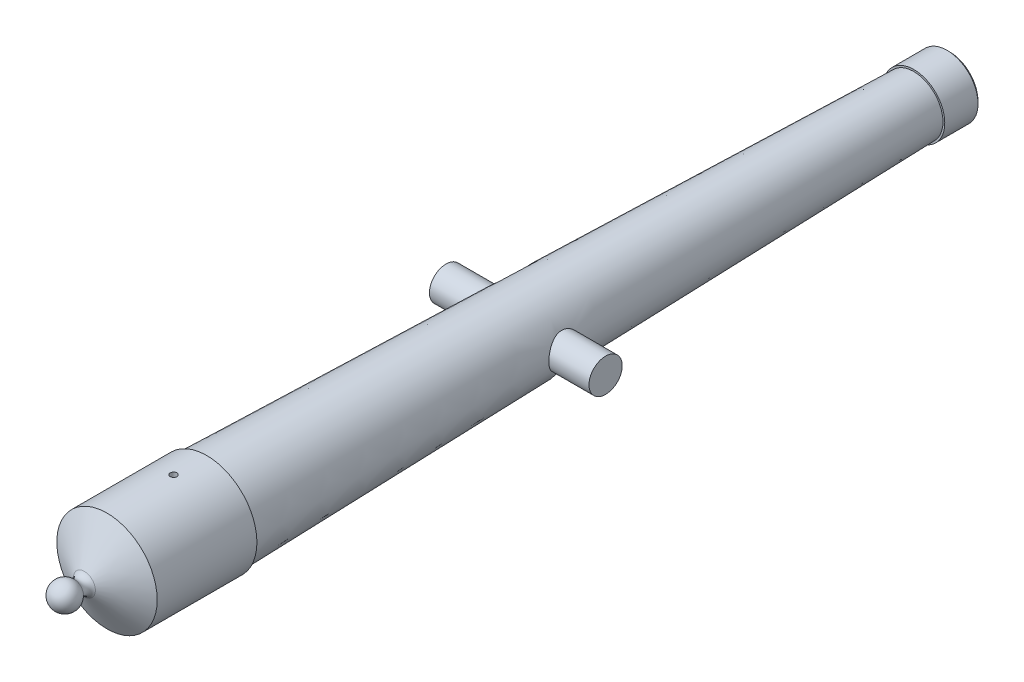
ISO-10303-21;
HEADER;
FILE_DESCRIPTION(('STEP AP214'),'2;1');
FILE_NAME('part.step','',(''),(''),'','','');
FILE_SCHEMA(('AUTOMOTIVE_DESIGN { 1 0 10303 214 1 1 1 1 }'));
ENDSEC;
DATA;
#1=APPLICATION_CONTEXT('core data for automotive mechanical design processes');
#2=APPLICATION_PROTOCOL_DEFINITION('international standard','automotive_design',2000,#1);
#3=PRODUCT_CONTEXT('',#1,'mechanical');
#4=PRODUCT('Part','Part','',(#3));
#5=PRODUCT_RELATED_PRODUCT_CATEGORY('part','',(#4));
#6=PRODUCT_DEFINITION_FORMATION('','',#4);
#7=PRODUCT_DEFINITION_CONTEXT('part definition',#1,'design');
#8=PRODUCT_DEFINITION('design','',#6,#7);
#9=PRODUCT_DEFINITION_SHAPE('','',#8);
#10=(LENGTH_UNIT() NAMED_UNIT(*) SI_UNIT(.MILLI.,.METRE.));
#11=(NAMED_UNIT(*) PLANE_ANGLE_UNIT() SI_UNIT($,.RADIAN.));
#12=(NAMED_UNIT(*) SI_UNIT($,.STERADIAN.) SOLID_ANGLE_UNIT());
#13=UNCERTAINTY_MEASURE_WITH_UNIT(LENGTH_MEASURE(1.E-05),#10,'distance_accuracy_value','');
#14=(GEOMETRIC_REPRESENTATION_CONTEXT(3) GLOBAL_UNCERTAINTY_ASSIGNED_CONTEXT((#13)) GLOBAL_UNIT_ASSIGNED_CONTEXT((#10,
#11,#12)) REPRESENTATION_CONTEXT('',''));
#15=CARTESIAN_POINT('',(0.,0.,0.));
#16=DIRECTION('',(0.,0.,1.));
#17=DIRECTION('',(1.,0.,0.));
#18=AXIS2_PLACEMENT_3D('',#15,#16,#17);
#19=CARTESIAN_POINT('',(0.,0.,101.6));
#20=DIRECTION('',(0.,0.,1.));
#21=DIRECTION('',(1.,0.,0.));
#22=AXIS2_PLACEMENT_3D('',#19,#20,#21);
#23=CYLINDRICAL_SURFACE('',#22,2.8321);
#24=CARTESIAN_POINT('',(0.,0.,-76.2000000000001));
#25=DIRECTION('',(0.,0.,1.));
#26=DIRECTION('',(1.,0.,0.));
#27=AXIS2_PLACEMENT_3D('',#24,#25,#26);
#28=CIRCLE('',#27,2.8321);
#29=CARTESIAN_POINT('',(2.8321,0.,-76.2000000000001));
#30=VERTEX_POINT('',#29);
#31=EDGE_CURVE('E53',#30,#30,#28,.T.);
#32=ORIENTED_EDGE('',*,*,#31,.F.);
#33=EDGE_LOOP('',(#32));
#34=FACE_BOUND('',#33,.T.);
#35=CARTESIAN_POINT('',(0.,0.,76.2000000000001));
#36=DIRECTION('',(0.,0.,1.));
#37=DIRECTION('',(1.,0.,0.));
#38=AXIS2_PLACEMENT_3D('',#35,#36,#37);
#39=CIRCLE('',#38,2.8321);
#40=CARTESIAN_POINT('',(2.8321,0.,76.2000000000001));
#41=VERTEX_POINT('',#40);
#42=EDGE_CURVE('E48',#41,#41,#39,.T.);
#43=ORIENTED_EDGE('',*,*,#42,.T.);
#44=EDGE_LOOP('',(#43));
#45=FACE_BOUND('',#44,.T.);
#46=CARTESIAN_POINT('',(0.,2.8321,66.6750000000001));
#47=CARTESIAN_POINT('',(0.0351963524602618,2.83209935485914,66.6750011701939));
#48=CARTESIAN_POINT('',(0.0704066552407901,2.83143724201221,66.6779361345388));
#49=CARTESIAN_POINT('',(0.139825618917245,2.82885992638437,66.6895853654994));
#50=CARTESIAN_POINT('',(0.174033571755433,2.82694385909442,66.6983036193229));
#51=CARTESIAN_POINT('',(0.240434686856917,2.82207178106052,66.7212314439598));
#52=CARTESIAN_POINT('',(0.272629964196245,2.81911688439737,66.7354351335811));
#53=CARTESIAN_POINT('',(0.334179599664716,2.81248535592582,66.768911625848));
#54=CARTESIAN_POINT('',(0.363534002374701,2.80880873544592,66.7881843489294));
#55=CARTESIAN_POINT('',(0.419063026986945,2.80106681911568,66.8315945928335));
#56=CARTESIAN_POINT('',(0.445183057813848,2.79699650054715,66.8558010547614));
#57=CARTESIAN_POINT('',(0.493028340785627,2.78896098338428,66.9082437060078));
#58=CARTESIAN_POINT('',(0.514753184984016,2.78499579457739,66.9364802689723));
#59=CARTESIAN_POINT('',(0.553434896322026,2.77756979577129,66.9965885931296));
#60=CARTESIAN_POINT('',(0.570333156645345,2.7741154125485,67.0284989348748));
#61=CARTESIAN_POINT('',(0.598505932135779,2.76817444149332,67.0947967419668));
#62=CARTESIAN_POINT('',(0.609781156587524,2.76568773160819,67.1291838942645));
#63=CARTESIAN_POINT('',(0.626206405460516,2.76201489990233,67.1988656064357));
#64=CARTESIAN_POINT('',(0.631453342776651,2.76080822481908,67.2341362153347));
#65=CARTESIAN_POINT('',(0.635974507122057,2.75977039435726,67.3050761285127));
#66=CARTESIAN_POINT('',(0.635249507044634,2.75993906098075,67.3407453806023));
#67=CARTESIAN_POINT('',(0.627925254798687,2.76161427078073,67.4107459626567));
#68=CARTESIAN_POINT('',(0.621439055956033,2.7630950644541,67.4450898316111));
#69=CARTESIAN_POINT('',(0.602955841259217,2.76718691551238,67.5121891859686));
#70=CARTESIAN_POINT('',(0.590958502179467,2.76979803919006,67.5449445780838));
#71=CARTESIAN_POINT('',(0.561691020798786,2.77588142441652,67.6082525367978));
#72=CARTESIAN_POINT('',(0.544377817967379,2.779360673316,67.6387844969479));
#73=CARTESIAN_POINT('',(0.505000315647921,2.78678405826388,67.6965514610428));
#74=CARTESIAN_POINT('',(0.482935337474432,2.79072826068409,67.7237859931545));
#75=CARTESIAN_POINT('',(0.434084313275282,2.79874728246331,67.774835417385));
#76=CARTESIAN_POINT('',(0.407202250497429,2.80282303155951,67.798558376429));
#77=CARTESIAN_POINT('',(0.349794629970767,2.81056430259154,67.8411747861984));
#78=CARTESIAN_POINT('',(0.319268999568012,2.81422981634433,67.8600681405963));
#79=CARTESIAN_POINT('',(0.25532540181894,2.8207504776185,67.8925135472286));
#80=CARTESIAN_POINT('',(0.221900872852387,2.82360372063829,67.9060530749619));
#81=CARTESIAN_POINT('',(0.153172769477996,2.82816426854037,67.9272975598389));
#82=CARTESIAN_POINT('',(0.11786948341276,2.82987174872454,67.9350034095592));
#83=CARTESIAN_POINT('',(0.047174136899716,2.83192326657826,67.94422697471));
#84=CARTESIAN_POINT('',(0.0117992323502716,2.83229495480176,67.9458702041948));
#85=CARTESIAN_POINT('',(-0.0587196603745117,2.831710704929,67.9432627571052));
#86=CARTESIAN_POINT('',(-0.0938636648712814,2.83075486170767,67.9390125017217));
#87=CARTESIAN_POINT('',(-0.162503900824789,2.82764044507157,67.9248427273887));
#88=CARTESIAN_POINT('',(-0.196014508525435,2.82549593878739,67.9149894818526));
#89=CARTESIAN_POINT('',(-0.260907072196644,2.82024442979528,67.8899673397754));
#90=CARTESIAN_POINT('',(-0.29228884031319,2.81713734228115,67.8747979748533));
#91=CARTESIAN_POINT('',(-0.352548676075544,2.81023739629906,67.83931575125));
#92=CARTESIAN_POINT('',(-0.381382548310373,2.80643502289873,67.8189297270546));
#93=CARTESIAN_POINT('',(-0.435265071618265,2.79858489727152,67.7736887310025));
#94=CARTESIAN_POINT('',(-0.46031320346165,2.79453711149183,67.7488331471494));
#95=CARTESIAN_POINT('',(-0.506413024676474,2.78655617662403,67.6947813607716));
#96=CARTESIAN_POINT('',(-0.527377591714516,2.78262678389646,67.6655101933322));
#97=CARTESIAN_POINT('',(-0.564094139235672,2.77541703577372,67.6037890139334));
#98=CARTESIAN_POINT('',(-0.57984634862883,2.77213665187872,67.5713391416537));
#99=CARTESIAN_POINT('',(-0.605582121410344,2.76662864144735,67.5043574553291));
#100=CARTESIAN_POINT('',(-0.615598673848126,2.76439500822464,67.4698388349259));
#101=CARTESIAN_POINT('',(-0.629674162248547,2.76122325655301,67.399551549496));
#102=CARTESIAN_POINT('',(-0.633734106984656,2.76028491874264,67.3637830971836));
#103=CARTESIAN_POINT('',(-0.635736516960403,2.75982431817365,67.2928911665245));
#104=CARTESIAN_POINT('',(-0.633817283811176,2.76027004056894,67.2577717327282));
#105=CARTESIAN_POINT('',(-0.624226224060342,2.76245466521834,67.1883704739342));
#106=CARTESIAN_POINT('',(-0.61655447251639,2.76419355059952,67.1540886380137));
#107=CARTESIAN_POINT('',(-0.595744486465689,2.76875258000252,67.0874523154646));
#108=CARTESIAN_POINT('',(-0.58262735216757,2.77156854718437,67.055090934589));
#109=CARTESIAN_POINT('',(-0.551316723581451,2.77796589041847,66.9930079960386));
#110=CARTESIAN_POINT('',(-0.533122669767625,2.78154735082533,66.9632867298061));
#111=CARTESIAN_POINT('',(-0.491720152309636,2.78916705336809,66.9066481193888));
#112=CARTESIAN_POINT('',(-0.468413547098827,2.79321337057468,66.8798035889343));
#113=CARTESIAN_POINT('',(-0.417645170024492,2.80125368082617,66.8303612887077));
#114=CARTESIAN_POINT('',(-0.390182435913955,2.80524766152057,66.807764505118));
#115=CARTESIAN_POINT('',(-0.331424942427255,2.81279866876162,66.7671598839993));
#116=CARTESIAN_POINT('',(-0.300082578068513,2.81634891308478,66.7492195976392));
#117=CARTESIAN_POINT('',(-0.23475345991419,2.82254389131537,66.7188904703999));
#118=CARTESIAN_POINT('',(-0.200768898243394,2.82518936623882,66.7064970839685));
#119=CARTESIAN_POINT('',(-0.138970661939898,2.82881793978781,66.689761953138));
#120=CARTESIAN_POINT('',(-0.111485324218245,2.83004095471679,66.6842370068206));
#121=CARTESIAN_POINT('',(-0.0560029185259434,2.83168222189339,66.6768556540354));
#122=CARTESIAN_POINT('',(-0.028005875548816,2.83210051334111,66.6749990688722));
#123=CARTESIAN_POINT('',(0.,2.8321,66.6750000000001));
#124=B_SPLINE_CURVE_WITH_KNOTS('',3,(#46,#47,#48,#49,#50,#51,#52,#53,#54,#55,#56,#57,#58,#59,
#60,#61,#62,#63,#64,#65,#66,#67,#68,#69,#70,#71,#72,#73,#74,#75,#76,#77,#78,#79,#80,#81,#82,#83,
#84,#85,#86,#87,#88,#89,#90,#91,#92,#93,#94,#95,#96,#97,#98,#99,#100,#101,#102,#103,#104,#105,
#106,#107,#108,#109,#110,#111,#112,#113,#114,#115,#116,#117,#118,#119,#120,#121,#122,#123),
.UNSPECIFIED.,.T.,.F.,(4,2,2,2,2,2,2,2,2,2,2,2,2,2,2,2,2,2,2,2,2,2,2,2,2,2,2,2,2,2,2,2,2,2,2,2,
2,2,4),(0.,0.105486525546016,0.211045852987066,0.316492318129971,0.421937128270393,
0.528971127894894,0.636015057503189,0.744308308306199,0.852587895639793,0.959101249686989,
1.06560081890033,1.1700555887756,1.27451648565262,1.37984693562243,1.48519243969417,
1.59293547407842,1.70068065725356,1.80867642425109,1.9166556641113,2.02238645649506,
2.12810969298667,2.23260767562303,2.33711486745447,2.44317688225452,2.54925343071576,
2.65739137014389,2.76552455986976,2.87302939994838,2.98051603158365,3.08553505053502,
3.19055269924408,3.2951671602089,3.39979315525987,3.50663754724385,3.61350671430867,
3.72184904343782,3.83010242532253,3.91404255602459,3.9979785976884),.UNSPECIFIED.);
#125=CARTESIAN_POINT('',(0.,2.8321,66.6750000000001));
#126=VERTEX_POINT('',#125);
#127=EDGE_CURVE('E114',#126,#126,#124,.T.);
#128=ORIENTED_EDGE('',*,*,#127,.F.);
#129=EDGE_LOOP('',(#128));
#130=FACE_BOUND('',#129,.T.);
#131=ADVANCED_FACE('F32',(#34,#45,#130),#23,.F.);
#132=CARTESIAN_POINT('',(0.,0.,101.6));
#133=DIRECTION('',(0.,0.,1.));
#134=DIRECTION('',(1.,0.,0.));
#135=AXIS2_PLACEMENT_3D('',#132,#133,#134);
#136=CYLINDRICAL_SURFACE('',#135,9.58833936230612);
#137=CARTESIAN_POINT('',(0.,0.,80.01));
#138=DIRECTION('',(0.,0.,1.));
#139=DIRECTION('',(1.,0.,0.));
#140=AXIS2_PLACEMENT_3D('',#137,#138,#139);
#141=CIRCLE('',#140,9.58833936230612);
#142=CARTESIAN_POINT('',(9.58833936230612,0.,80.01));
#143=VERTEX_POINT('',#142);
#144=EDGE_CURVE('E154',#143,#143,#141,.T.);
#145=ORIENTED_EDGE('',*,*,#144,.F.);
#146=EDGE_LOOP('',(#145));
#147=FACE_BOUND('',#146,.T.);
#148=CARTESIAN_POINT('',(0.,0.,60.9600000000001));
#149=DIRECTION('',(0.,0.,1.));
#150=DIRECTION('',(1.,0.,0.));
#151=AXIS2_PLACEMENT_3D('',#148,#149,#150);
#152=CIRCLE('',#151,9.58833936230612);
#153=CARTESIAN_POINT('',(9.58833936230612,0.,60.9600000000001));
#154=VERTEX_POINT('',#153);
#155=EDGE_CURVE('E157',#154,#154,#152,.T.);
#156=ORIENTED_EDGE('',*,*,#155,.T.);
#157=EDGE_LOOP('',(#156));
#158=FACE_BOUND('',#157,.T.);
#159=CARTESIAN_POINT('',(0.,9.58833936230612,66.6750000000001));
#160=CARTESIAN_POINT('',(-0.0356263381764343,9.58833908340412,66.675001565858));
#161=CARTESIAN_POINT('',(-0.0712775124958322,9.58813868058843,66.6780082716786));
#162=CARTESIAN_POINT('',(-0.141595137635909,9.58735850071565,66.6899592847891));
#163=CARTESIAN_POINT('',(-0.176260398522241,9.58677828396668,66.6989104738889));
#164=CARTESIAN_POINT('',(-0.243577485565111,9.58530410314541,66.722491948931));
#165=CARTESIAN_POINT('',(-0.276230375290769,9.58441030650605,66.7371192046337));
#166=CARTESIAN_POINT('',(-0.338608997471518,9.58240944670513,66.7716326027186));
#167=CARTESIAN_POINT('',(-0.368335391194416,9.58130243189002,66.7915175533177));
#168=CARTESIAN_POINT('',(-0.424075085208356,9.57899747572216,66.8360180194038));
#169=CARTESIAN_POINT('',(-0.450082866723912,9.57779940318508,66.8606404412939));
#170=CARTESIAN_POINT('',(-0.497599842001435,9.57544847784538,66.9139025913876));
#171=CARTESIAN_POINT('',(-0.519108846308606,9.57429562694882,66.9425424886924));
#172=CARTESIAN_POINT('',(-0.557035086344867,9.57216412795181,67.0030583437478));
#173=CARTESIAN_POINT('',(-0.573447678419611,9.57118563906715,67.0349372178391));
#174=CARTESIAN_POINT('',(-0.600685499988818,9.56951492773157,67.1010056787514));
#175=CARTESIAN_POINT('',(-0.611510795631856,9.56882270189158,67.1351952382104));
#176=CARTESIAN_POINT('',(-0.627251261026589,9.56780384178496,67.2048608927967));
#177=CARTESIAN_POINT('',(-0.632175156167297,9.56747666782829,67.2403350084631));
#178=CARTESIAN_POINT('',(-0.635999987923012,9.56722319167062,67.3116076340199));
#179=CARTESIAN_POINT('',(-0.634900999815673,9.56729688445936,67.3474061398502));
#180=CARTESIAN_POINT('',(-0.626718496348319,9.56783633052427,67.4182518499238));
#181=CARTESIAN_POINT('',(-0.61964442927196,9.56830146481688,67.453300150789));
#182=CARTESIAN_POINT('',(-0.599727233553266,9.5695704037247,67.5217107615775));
#183=CARTESIAN_POINT('',(-0.5868840668847,9.57037421057223,67.5550730603862));
#184=CARTESIAN_POINT('',(-0.555782539486094,9.57223062607182,67.6191949501474));
#185=CARTESIAN_POINT('',(-0.537519900169492,9.57328343117018,67.6499524599068));
#186=CARTESIAN_POINT('',(-0.496100934369649,9.57551900863177,67.7079689250711));
#187=CARTESIAN_POINT('',(-0.472944545894756,9.5767017826413,67.7352278361504));
#188=CARTESIAN_POINT('',(-0.422342227416284,9.57906676098503,67.7855282896488));
#189=CARTESIAN_POINT('',(-0.394888121900467,9.58024895983487,67.8085616085534));
#190=CARTESIAN_POINT('',(-0.33649832925831,9.58247737977207,67.8496935908372));
#191=CARTESIAN_POINT('',(-0.305562640770609,9.58352360080626,67.8677922522868));
#192=CARTESIAN_POINT('',(-0.241082788540885,9.58536227400322,67.8985404981024));
#193=CARTESIAN_POINT('',(-0.207538471847826,9.586154711272,67.9111897626704));
#194=CARTESIAN_POINT('',(-0.138795826628237,9.58739632813821,67.930674613478));
#195=CARTESIAN_POINT('',(-0.103597519791943,9.58784551223569,67.937510275934));
#196=CARTESIAN_POINT('',(-0.0326173838901671,9.58834942869641,67.9451636742789));
#197=CARTESIAN_POINT('',(0.00316321436565463,9.58840490618591,67.9459927781988));
#198=CARTESIAN_POINT('',(0.0743549643529414,9.58811714133276,67.9416392393711));
#199=CARTESIAN_POINT('',(0.109766118245429,9.58777390132369,67.9364566318082));
#200=CARTESIAN_POINT('',(0.179181700618725,9.58672781487848,67.9202361994703));
#201=CARTESIAN_POINT('',(0.213187355072257,9.58602528930986,67.9092035988313));
#202=CARTESIAN_POINT('',(0.278864504084136,9.58433964918834,67.8816016658911));
#203=CARTESIAN_POINT('',(0.31053597509481,9.58335653180525,67.8650322777432));
#204=CARTESIAN_POINT('',(0.370697727595723,9.58121827577734,67.8267982336522));
#205=CARTESIAN_POINT('',(0.399183180876022,9.58006288207826,67.8051259949369));
#206=CARTESIAN_POINT('',(0.452115674885338,9.57771092298612,67.7573124689324));
#207=CARTESIAN_POINT('',(0.476562671089189,9.5765143571393,67.7311711323765));
#208=CARTESIAN_POINT('',(0.520762876300027,9.57421274825703,67.6751123759949));
#209=CARTESIAN_POINT('',(0.540508703355369,9.57310785091212,67.6451891289812));
#210=CARTESIAN_POINT('',(0.57469554533094,9.57111651029325,67.582445204901));
#211=CARTESIAN_POINT('',(0.58913659621136,9.57023006553844,67.5496245474776));
#212=CARTESIAN_POINT('',(0.612291207054163,9.5687766521329,67.4820442932158));
#213=CARTESIAN_POINT('',(0.621009393031656,9.56820942549876,67.4472862871325));
#214=CARTESIAN_POINT('',(0.632485897839024,9.56745770331832,67.3767959408195));
#215=CARTESIAN_POINT('',(0.635244284495478,9.56727320341634,67.3410636116829));
#216=CARTESIAN_POINT('',(0.63472221946956,9.56730784728902,67.2697123199176));
#217=CARTESIAN_POINT('',(0.631453371873284,9.5675262154322,67.2340932714271));
#218=CARTESIAN_POINT('',(0.618993709667073,9.56834034464386,67.1639110163007));
#219=CARTESIAN_POINT('',(0.609802884550793,9.56893610638189,67.1293478115382));
#220=CARTESIAN_POINT('',(0.585762832237384,9.57043769538769,67.0622567906806));
#221=CARTESIAN_POINT('',(0.570913681327877,9.57134351847509,67.0297289471509));
#222=CARTESIAN_POINT('',(0.535980016534799,9.57336314552924,66.9676264177384));
#223=CARTESIAN_POINT('',(0.515895629766568,9.574476944446,66.9380516601767));
#224=CARTESIAN_POINT('',(0.471018511622355,9.5767895249299,66.8826358340605));
#225=CARTESIAN_POINT('',(0.446217339897961,9.57798845638806,66.856801607153));
#226=CARTESIAN_POINT('',(0.392622981784599,9.58033489981896,66.8096539970795));
#227=CARTESIAN_POINT('',(0.363828821933992,9.58148239916237,66.7883417195474));
#228=CARTESIAN_POINT('',(0.303029541678256,9.58359800322181,66.7508253023406));
#229=CARTESIAN_POINT('',(0.271020189597222,9.58456586661274,66.7346280140165));
#230=CARTESIAN_POINT('',(0.204752938631347,9.5862099874925,66.7078576822841));
#231=CARTESIAN_POINT('',(0.170497718337614,9.58688658533015,66.6972780711278));
#232=CARTESIAN_POINT('',(0.113361730512231,9.58769520169712,66.6847844338146));
#233=CARTESIAN_POINT('',(0.0908500093664952,9.58793568427544,66.6811200363836));
#234=CARTESIAN_POINT('',(0.0455622451409613,9.58825785364645,66.6762273206381));
#235=CARTESIAN_POINT('',(0.0227862024766167,9.58833954068869,66.6749989984951));
#236=CARTESIAN_POINT('',(0.,9.58833936230612,66.6750000000001));
#237=B_SPLINE_CURVE_WITH_KNOTS('',3,(#159,#160,#161,#162,#163,#164,#165,#166,#167,#168,#169,
#170,#171,#172,#173,#174,#175,#176,#177,#178,#179,#180,#181,#182,#183,#184,#185,#186,#187,#188,
#189,#190,#191,#192,#193,#194,#195,#196,#197,#198,#199,#200,#201,#202,#203,#204,#205,#206,#207,
#208,#209,#210,#211,#212,#213,#214,#215,#216,#217,#218,#219,#220,#221,#222,#223,#224,#225,#226,
#227,#228,#229,#230,#231,#232,#233,#234,#235,#236),.UNSPECIFIED.,.T.,.F.,(4,2,2,2,2,2,2,2,2,2,2,
2,2,2,2,2,2,2,2,2,2,2,2,2,2,2,2,2,2,2,2,2,2,2,2,2,2,2,4),(0.,0.106795829601662,
0.213715510636647,0.320578189609931,0.42741666632006,0.534412091362312,0.641412021343529,
0.748509161379615,0.855605033452587,0.962542365111097,1.06947836020492,1.17624557524107,
1.28301349402906,1.38986592964576,1.49671971889864,1.60377930227428,1.71083892751228,
1.81790483468973,1.92496933820878,2.03183115805585,2.13869235247614,2.24545827848562,
2.35222528142208,2.45915195138458,2.56607980016614,2.673174459741,2.78026839332566,
2.88727565175114,2.99428169235465,3.10108193193563,3.20788236099443,3.31468135018164,
3.42147774645313,3.52846707659113,3.6354825359602,3.74264073672061,3.84967337911999,
3.91797888975845,3.98628429305054),.UNSPECIFIED.);
#238=CARTESIAN_POINT('',(0.,9.58833936230612,66.6750000000001));
#239=VERTEX_POINT('',#238);
#240=EDGE_CURVE('E10',#239,#239,#237,.T.);
#241=ORIENTED_EDGE('',*,*,#240,.F.);
#242=EDGE_LOOP('',(#241));
#243=FACE_BOUND('',#242,.T.);
#244=ADVANCED_FACE('F89',(#147,#158,#243),#136,.T.);
#245=CARTESIAN_POINT('',(0.,0.,-74.1436852739432));
#246=DIRECTION('',(0.,0.,1.));
#247=DIRECTION('',(1.,0.,0.));
#248=AXIS2_PLACEMENT_3D('',#245,#246,#247);
#249=CONICAL_SURFACE('',#248,5.55168305012148,0.0261799387799152);
#250=CARTESIAN_POINT('',(-7.1246128347311,-2.11225151051641,-2.37044691067342));
#251=CARTESIAN_POINT('',(-7.15999376364011,-1.98222892964537,-2.48630147221821));
#252=CARTESIAN_POINT('',(-7.19473527022546,-1.84237573152468,-2.59169004133909));
#253=CARTESIAN_POINT('',(-7.25915606273021,-1.54616934053915,-2.77862303466659));
#254=CARTESIAN_POINT('',(-7.28882490551409,-1.38978315656129,-2.86011851059022));
#255=CARTESIAN_POINT('',(-7.33983565995534,-1.06408999176591,-2.9965876068236));
#256=CARTESIAN_POINT('',(-7.36116068958053,-0.894757635529039,-3.05150750936889));
#257=CARTESIAN_POINT('',(-7.39290274933913,-0.548422700220657,-3.13232063943203));
#258=CARTESIAN_POINT('',(-7.40332946457271,-0.371427077281799,-3.15823964088036));
#259=CARTESIAN_POINT('',(-7.41184838362086,-0.0239170882217485,-3.17944733220351));
#260=CARTESIAN_POINT('',(-7.41051165154849,0.146497756379075,-3.17615408516061));
#261=CARTESIAN_POINT('',(-7.39701257942944,0.484183556321644,-3.14244869409472));
#262=CARTESIAN_POINT('',(-7.38484972664048,0.651454362373572,-3.11203526561671));
#263=CARTESIAN_POINT('',(-7.35134304577096,0.974961517901067,-3.02614696067529));
#264=CARTESIAN_POINT('',(-7.33017856530501,1.1313473882293,-2.9711606400656));
#265=CARTESIAN_POINT('',(-7.28082275895696,1.43276686450873,-2.83812658874332));
#266=CARTESIAN_POINT('',(-7.25262993216295,1.57779803694616,-2.76007393152542));
#267=CARTESIAN_POINT('',(-7.19027304309886,1.86090567341539,-2.57826806882757));
#268=CARTESIAN_POINT('',(-7.15586871014839,1.9981834075467,-2.47335443315792));
#269=CARTESIAN_POINT('',(-7.08584060098458,2.25384910289186,-2.24286434370983));
#270=CARTESIAN_POINT('',(-7.05021624157377,2.37222787251622,-2.11727789556571));
#271=CARTESIAN_POINT('',(-6.97974389844495,2.59334591367021,-1.84070961022607));
#272=CARTESIAN_POINT('',(-6.94504614218922,2.69486836337208,-1.68871151049311));
#273=CARTESIAN_POINT('',(-6.8832766233603,2.87082419925069,-1.36834038980815));
#274=CARTESIAN_POINT('',(-6.85620210906572,2.94526736293407,-1.19997330708046));
#275=CARTESIAN_POINT('',(-6.81462586851435,3.06213162077838,-0.857622460918351));
#276=CARTESIAN_POINT('',(-6.79971622855255,3.10558488676991,-0.684043215590818));
#277=CARTESIAN_POINT('',(-6.78353989641082,3.16268665063382,-0.331472413816595));
#278=CARTESIAN_POINT('',(-6.78226415033795,3.17635492309666,-0.152484528316582));
#279=CARTESIAN_POINT('',(-6.79347629068658,3.17354921981639,0.190187113202122));
#280=CARTESIAN_POINT('',(-6.80485510713671,3.15943241533724,0.353933545983246));
#281=CARTESIAN_POINT('',(-6.83847127247029,3.1064520029697,0.676208414620445));
#282=CARTESIAN_POINT('',(-6.8607104626372,3.06758419842116,0.834735960792438));
#283=CARTESIAN_POINT('',(-6.91397585069742,2.96618021737237,1.14420061043446));
#284=CARTESIAN_POINT('',(-6.94508755793479,2.90341161934449,1.29504613315503));
#285=CARTESIAN_POINT('',(-7.01294625934913,2.75621364024617,1.58438817562543));
#286=CARTESIAN_POINT('',(-7.04969540365024,2.67177598627277,1.7228799516362));
#287=CARTESIAN_POINT('',(-7.12899628271655,2.47469701852218,1.99686828019961));
#288=CARTESIAN_POINT('',(-7.171772378902,2.36019810107457,2.13096654723048));
#289=CARTESIAN_POINT('',(-7.25598227798737,2.11033975604448,2.37866661711723));
#290=CARTESIAN_POINT('',(-7.29741557258912,1.97497253815543,2.49226073108546));
#291=CARTESIAN_POINT('',(-7.37654566806763,1.68031944680577,2.70017511923543));
#292=CARTESIAN_POINT('',(-7.41402270442476,1.5202860362545,2.79352657113465));
#293=CARTESIAN_POINT('',(-7.4791561003,1.1847707133123,2.95148587730396));
#294=CARTESIAN_POINT('',(-7.50681773996703,1.00929717047055,3.0161091904932));
#295=CARTESIAN_POINT('',(-7.54784474289805,0.65928835489446,3.11075403216195));
#296=CARTESIAN_POINT('',(-7.5619808887804,0.485351861193323,3.14264981507779));
#297=CARTESIAN_POINT('',(-7.57724814791549,0.13406057313679,3.17706760490017));
#298=CARTESIAN_POINT('',(-7.57838522150381,-0.0432926172247866,3.17960307410678));
#299=CARTESIAN_POINT('',(-7.56792255195734,-0.38341109626145,3.15605520432914));
#300=CARTESIAN_POINT('',(-7.55719014936829,-0.546343313183532,3.13192081514454));
#301=CARTESIAN_POINT('',(-7.5253947245455,-0.865558367735012,3.05912381759037));
#302=CARTESIAN_POINT('',(-7.50433100635781,-1.02184075663761,3.01045955679581));
#303=CARTESIAN_POINT('',(-7.45341404541591,-1.32610204075357,2.88951253153468));
#304=CARTESIAN_POINT('',(-7.42343706583766,-1.47392654964094,2.81689558252814));
#305=CARTESIAN_POINT('',(-7.35742746992832,-1.75564330390697,2.65049671889033));
#306=CARTESIAN_POINT('',(-7.32139275368677,-1.88953069184178,2.55670746101339));
#307=CARTESIAN_POINT('',(-7.24331485326426,-2.15067454704954,2.34221094678358));
#308=CARTESIAN_POINT('',(-7.20102230297838,-2.27660337778855,2.21997655519692));
#309=CARTESIAN_POINT('',(-7.11684885102909,-2.5067838152281,1.95635041729137));
#310=CARTESIAN_POINT('',(-7.07496816505039,-2.6110245860716,1.81494915274487));
#311=CARTESIAN_POINT('',(-6.99393094042303,-2.79959791580668,1.50886348450374));
#312=CARTESIAN_POINT('',(-6.95499482993248,-2.88276506144415,1.34339731053314));
#313=CARTESIAN_POINT('',(-6.88689055859711,-3.01949559472005,0.998785264275071));
#314=CARTESIAN_POINT('',(-6.85771614268839,-3.07307795396059,0.819648242679327));
#315=CARTESIAN_POINT('',(-6.81437290896255,-3.14584344390147,0.4639563577973));
#316=CARTESIAN_POINT('',(-6.79941615676658,-3.16687971271875,0.287879428672782));
#317=CARTESIAN_POINT('',(-6.78342066010366,-3.17923885418155,-0.0658902726941524));
#318=CARTESIAN_POINT('',(-6.78237323040945,-3.17058027306804,-0.243581967269628));
#319=CARTESIAN_POINT('',(-6.79343562992421,-3.12572388657815,-0.5805806351356));
#320=CARTESIAN_POINT('',(-6.80450857689991,-3.09176460997802,-0.74022803019675));
#321=CARTESIAN_POINT('',(-6.83647745679473,-3.00017637957253,-1.0516299423528));
#322=CARTESIAN_POINT('',(-6.8573804375624,-2.94253044687294,-1.20337870951844));
#323=CARTESIAN_POINT('',(-6.90703789649572,-2.80349329421534,-1.49953345014391));
#324=CARTESIAN_POINT('',(-6.93599955886204,-2.72147094311343,-1.6436059469076));
#325=CARTESIAN_POINT('',(-6.99807972728765,-2.53669930960379,-1.91647070371086));
#326=CARTESIAN_POINT('',(-7.03119080599567,-2.43398686722855,-2.04528948559071));
#327=CARTESIAN_POINT('',(-7.07463302480727,-2.28876583597861,-2.2010401889124));
#328=CARTESIAN_POINT('',(-7.08465039286108,-2.25456878110794,-2.23605418797465));
#329=CARTESIAN_POINT('',(-7.10466630286236,-2.1845907677328,-2.30447028613746));
#330=CARTESIAN_POINT('',(-7.11466484373502,-2.14880972149835,-2.33787229574268));
#331=CARTESIAN_POINT('',(-7.1246128347311,-2.11225151051641,-2.37044691067342));
#332=B_SPLINE_CURVE_WITH_KNOTS('',3,(#250,#251,#252,#253,#254,#255,#256,#257,#258,#259,#260,
#261,#262,#263,#264,#265,#266,#267,#268,#269,#270,#271,#272,#273,#274,#275,#276,#277,#278,#279,
#280,#281,#282,#283,#284,#285,#286,#287,#288,#289,#290,#291,#292,#293,#294,#295,#296,#297,#298,
#299,#300,#301,#302,#303,#304,#305,#306,#307,#308,#309,#310,#311,#312,#313,#314,#315,#316,#317,
#318,#319,#320,#321,#322,#323,#324,#325,#326,#327,#328,#329,#330,#331),.UNSPECIFIED.,.T.,.F.,(4,
2,2,2,2,2,2,2,2,2,2,2,2,2,2,2,2,2,2,2,2,2,2,2,2,2,2,2,2,2,2,2,2,2,2,2,2,2,2,2,4),(0.,
0.532943065217061,1.06697042828028,1.6020727692455,2.13669917078285,2.64552050479345,
3.15436593867349,3.65351596208527,4.15277267103991,4.67899508570945,5.2054726562433,
5.76087991966074,6.31608644287927,6.85180704225732,7.38717186223581,7.87907001232739,
8.37105158851089,8.86794491220939,9.36502822488174,9.90697228427663,10.4491191479152,
11.0132592965639,11.577095506803,12.1064530755463,12.6355679134785,13.1284298040472,
13.6213249000963,14.1214102174117,14.6216692477996,15.1608730512573,15.7003456099048,
16.2651635614911,16.8296188948214,17.3605680946157,17.8911857447279,18.3797213979788,
18.8686078523581,19.3714565693522,19.8734177229341,20.0232560394592,20.1731026652456),.UNSPECIFIED.);
#333=CARTESIAN_POINT('',(-7.1246128347311,-2.11225151051641,-2.37044691067342));
#334=VERTEX_POINT('',#333);
#335=EDGE_CURVE('E61',#334,#334,#332,.T.);
#336=ORIENTED_EDGE('',*,*,#335,.T.);
#337=EDGE_LOOP('',(#336));
#338=FACE_BOUND('',#337,.T.);
#339=CARTESIAN_POINT('',(0.,0.,60.9600000000001));
#340=DIRECTION('',(0.,0.,1.));
#341=DIRECTION('',(1.,0.,0.));
#342=AXIS2_PLACEMENT_3D('',#339,#340,#341);
#343=CIRCLE('',#342,9.08949755641311);
#344=CARTESIAN_POINT('',(9.08949755641311,0.,60.9600000000001));
#345=VERTEX_POINT('',#344);
#346=EDGE_CURVE('E160',#345,#345,#343,.T.);
#347=ORIENTED_EDGE('',*,*,#346,.F.);
#348=EDGE_LOOP('',(#347));
#349=FACE_BOUND('',#348,.T.);
#350=CARTESIAN_POINT('',(0.,0.,-74.1436852739432));
#351=DIRECTION('',(0.,0.,1.));
#352=DIRECTION('',(1.,0.,0.));
#353=AXIS2_PLACEMENT_3D('',#350,#351,#352);
#354=CIRCLE('',#353,5.55168305012148);
#355=CARTESIAN_POINT('',(5.55168305012148,0.,-74.1436852739432));
#356=VERTEX_POINT('',#355);
#357=EDGE_CURVE('E163',#356,#356,#354,.T.);
#358=ORIENTED_EDGE('',*,*,#357,.T.);
#359=EDGE_LOOP('',(#358));
#360=FACE_BOUND('',#359,.T.);
#361=CARTESIAN_POINT('',(7.03678790107482,-2.41352212551041,-2.06289504087623));
#362=CARTESIAN_POINT('',(7.07276237134847,-2.29769028393076,-2.19839984596272));
#363=CARTESIAN_POINT('',(7.10978633967828,-2.17042319216163,-2.3241535483214));
#364=CARTESIAN_POINT('',(7.18165216317524,-1.89597234289309,-2.55303086270919));
#365=CARTESIAN_POINT('',(7.21648836927718,-1.74873989563919,-2.65609748321665));
#366=CARTESIAN_POINT('',(7.28001731704858,-1.43770614126436,-2.83653955250674));
#367=CARTESIAN_POINT('',(7.30870145647904,-1.27388209950665,-2.91387911009043));
#368=CARTESIAN_POINT('',(7.35648318992923,-0.934338827130744,-3.03979710056039));
#369=CARTESIAN_POINT('',(7.37559075784806,-0.758632189549267,-3.08840546618779));
#370=CARTESIAN_POINT('',(7.40132541495661,-0.408842807794995,-3.1533548550829));
#371=CARTESIAN_POINT('',(7.40848516841518,-0.235055797099126,-3.17107471266452));
#372=CARTESIAN_POINT('',(7.41117111959235,0.113160017116516,-3.17775521279095));
#373=CARTESIAN_POINT('',(7.40669873126239,0.287588740058859,-3.16671935075288));
#374=CARTESIAN_POINT('',(7.38711027168846,0.623702910410172,-3.11755538166442));
#375=CARTESIAN_POINT('',(7.37249202648956,0.785605827800507,-3.08069369943022));
#376=CARTESIAN_POINT('',(7.33465777559466,1.10078241282169,-2.982641967394));
#377=CARTESIAN_POINT('',(7.31144078875566,1.25405509341577,-2.92144914127461));
#378=CARTESIAN_POINT('',(7.25785133857802,1.55306762676952,-2.77439051388619));
#379=CARTESIAN_POINT('',(7.2272760822016,1.69841680319147,-2.68780665044596));
#380=CARTESIAN_POINT('',(7.16246292492719,1.97307436379725,-2.49318289125928));
#381=CARTESIAN_POINT('',(7.1282234452281,2.10237578125313,-2.38513372946625));
#382=CARTESIAN_POINT('',(7.05722068242719,2.35030968471597,-2.14214104278145));
#383=CARTESIAN_POINT('',(7.02044149107466,2.46765391603316,-2.00588374208545));
#384=CARTESIAN_POINT('',(6.95105112621919,2.67812748749208,-1.71479277527697));
#385=CARTESIAN_POINT('',(6.9184403994177,2.77125423354129,-1.55995712171005));
#386=CARTESIAN_POINT('',(6.8617223847706,2.93061362141613,-1.23489584661646));
#387=CARTESIAN_POINT('',(6.83764062143907,2.99676562421873,-1.06462591321554));
#388=CARTESIAN_POINT('',(6.80200206547478,3.0990260619189,-0.714088178701294));
#389=CARTESIAN_POINT('',(6.79043467827643,3.13515990391309,-0.533828970565043));
#390=CARTESIAN_POINT('',(6.78240919674799,3.17412607725292,-0.184242884621858));
#391=CARTESIAN_POINT('',(6.78480287407246,3.17941931519668,-0.0152135404682793));
#392=CARTESIAN_POINT('',(6.8020780735908,3.16321890371123,0.320893805559768));
#393=CARTESIAN_POINT('',(6.81695911628053,3.14172628282071,0.487971882111473));
#394=CARTESIAN_POINT('',(6.85689209716768,3.07422319923791,0.809911205284877));
#395=CARTESIAN_POINT('',(6.8815924252081,3.02904468464026,0.964993634143024));
#396=CARTESIAN_POINT('',(6.93861531437211,2.91638892260507,1.2653245569552));
#397=CARTESIAN_POINT('',(6.97094016186438,2.84890498398747,1.41057008426355));
#398=CARTESIAN_POINT('',(7.04279724855367,2.68775956344713,1.69876827325899));
#399=CARTESIAN_POINT('',(7.08268601421442,2.59252921279076,1.84075402696787));
#400=CARTESIAN_POINT('',(7.16398778226212,2.38081928784761,2.10744869228261));
#401=CARTESIAN_POINT('',(7.20540151835105,2.26432937553838,2.23214914631931));
#402=CARTESIAN_POINT('',(7.28893619714421,2.00326884787136,2.47000525761359));
#403=CARTESIAN_POINT('',(7.33088995896679,1.85727305452964,2.58166414312093));
#404=CARTESIAN_POINT('',(7.40787271647437,1.54687340844417,2.77877304699011));
#405=CARTESIAN_POINT('',(7.44290310674048,1.38247327337616,2.86422834548109));
#406=CARTESIAN_POINT('',(7.50135918674641,1.04457590514548,3.00364710177614));
#407=CARTESIAN_POINT('',(7.52509273145002,0.871482266493541,3.0584541150313));
#408=CARTESIAN_POINT('',(7.55977698629764,0.517289632262378,3.13781998151036));
#409=CARTESIAN_POINT('',(7.57073599725163,0.336195914584796,3.16239847760324));
#410=CARTESIAN_POINT('',(7.57829907128171,-0.0131046865780621,3.17939329652193));
#411=CARTESIAN_POINT('',(7.5759885791149,-0.181174278469036,3.17424139007969));
#412=CARTESIAN_POINT('',(7.55975265625917,-0.51382459181421,3.13761068134746));
#413=CARTESIAN_POINT('',(7.54582808138221,-0.678405569419184,3.10613381887551));
#414=CARTESIAN_POINT('',(7.50810272660539,-0.996333949469168,3.01904022195986));
#415=CARTESIAN_POINT('',(7.48449780174478,-1.14983688209878,2.9639012519029));
#416=CARTESIAN_POINT('',(7.42953676832963,-1.44547418405433,2.83151594437846));
#417=CARTESIAN_POINT('',(7.39817883780916,-1.58760587071678,2.75426440975689));
#418=CARTESIAN_POINT('',(7.32816744857167,-1.86621811235245,2.57430983854235));
#419=CARTESIAN_POINT('',(7.28917809464899,-2.00177331904176,2.47030650366193));
#420=CARTESIAN_POINT('',(7.20886227698108,-2.25419616981474,2.24235980513043));
#421=CARTESIAN_POINT('',(7.16753456006525,-2.37105366256498,2.11840568258695));
#422=CARTESIAN_POINT('',(7.08337482496439,-2.59125716351361,1.84367905473073));
#423=CARTESIAN_POINT('',(7.0406445538054,-2.69305326468643,1.69162683416219));
#424=CARTESIAN_POINT('',(6.96149066400082,-2.86957246195529,1.37100194371341));
#425=CARTESIAN_POINT('',(6.92506618686234,-2.94429924487884,1.20243152757954));
#426=CARTESIAN_POINT('',(6.86364263447262,-3.06260455475566,0.856602693122761));
#427=CARTESIAN_POINT('',(6.83842524535873,-3.10678852196754,0.67959227981444));
#428=CARTESIAN_POINT('',(6.8016768211422,-3.16415314654907,0.319302466619309));
#429=CARTESIAN_POINT('',(6.79013265912929,-3.17736355188281,0.136029253544587));
#430=CARTESIAN_POINT('',(6.78244310297119,-3.17218471414929,-0.213554923622227));
#431=CARTESIAN_POINT('',(6.78498653552179,-3.15657368298429,-0.379884974291362));
#432=CARTESIAN_POINT('',(6.80176257918451,-3.09962144262074,-0.707553552588495));
#433=CARTESIAN_POINT('',(6.81600202129408,-3.05826520047524,-0.868889106049695));
#434=CARTESIAN_POINT('',(6.85373279083986,-2.95220650107447,-1.1797042611865));
#435=CARTESIAN_POINT('',(6.87708229728941,-2.8878631328013,-1.32932528476912));
#436=CARTESIAN_POINT('',(6.93011193394345,-2.73780477274326,-1.61590149698415));
#437=CARTESIAN_POINT('',(6.95978056383855,-2.65212855781782,-1.75287905517883));
#438=CARTESIAN_POINT('',(7.00595972828503,-2.51128595848723,-1.94422686337602));
#439=CARTESIAN_POINT('',(7.02127625312656,-2.46346706518887,-2.00446741662463));
#440=CARTESIAN_POINT('',(7.03678790107482,-2.41352212551041,-2.06289504087623));
#441=B_SPLINE_CURVE_WITH_KNOTS('',3,(#361,#362,#363,#364,#365,#366,#367,#368,#369,#370,#371,
#372,#373,#374,#375,#376,#377,#378,#379,#380,#381,#382,#383,#384,#385,#386,#387,#388,#389,#390,
#391,#392,#393,#394,#395,#396,#397,#398,#399,#400,#401,#402,#403,#404,#405,#406,#407,#408,#409,
#410,#411,#412,#413,#414,#415,#416,#417,#418,#419,#420,#421,#422,#423,#424,#425,#426,#427,#428,
#429,#430,#431,#432,#433,#434,#435,#436,#437,#438,#439,#440),.UNSPECIFIED.,.T.,.F.,(4,2,2,2,2,2,
2,2,2,2,2,2,2,2,2,2,2,2,2,2,2,2,2,2,2,2,2,2,2,2,2,2,2,2,2,2,2,2,2,4),(0.,0.545357864949645,
1.09207045616854,1.63954258507923,2.18644333643275,2.708237962336,3.22996916416923,
3.72775958103011,4.22560681482391,4.73917407847742,5.2529635202296,5.8010482778773,
6.34919172029156,6.89896199184948,7.44826646742609,7.95306610564558,8.45784636087768,
8.94597949717002,9.43425919671638,9.95870998687971,10.4834164879043,11.0462406248597,
11.6089512758261,12.155297501404,12.7012885164638,13.2032887188759,13.7052519334482,
14.1975244855329,14.6899128324172,15.2134303104478,15.7372310583436,16.298247978895,
16.8591884604693,17.4086635127144,17.9576106156127,18.4563771210286,18.9554351358989,
19.4470155906448,19.9377089372943,20.1728590074013),.UNSPECIFIED.);
#442=CARTESIAN_POINT('',(7.03678790107482,-2.41352212551041,-2.06289504087623));
#443=VERTEX_POINT('',#442);
#444=EDGE_CURVE('E44',#443,#443,#441,.T.);
#445=ORIENTED_EDGE('',*,*,#444,.F.);
#446=EDGE_LOOP('',(#445));
#447=FACE_BOUND('',#446,.T.);
#448=ADVANCED_FACE('F66',(#338,#349,#360,#447),#249,.T.);
#449=CARTESIAN_POINT('',(0.,2.8321,76.2000000000001));
#450=DIRECTION('',(0.,0.,1.));
#451=DIRECTION('',(1.,0.,0.));
#452=AXIS2_PLACEMENT_3D('',#449,#450,#451);
#453=PLANE('',#452);
#454=ORIENTED_EDGE('',*,*,#42,.F.);
#455=EDGE_LOOP('',(#454));
#456=FACE_BOUND('',#455,.T.);
#457=ADVANCED_FACE('F34',(#456),#453,.F.);
#458=CARTESIAN_POINT('',(0.,0.,-76.2000000000001));
#459=DIRECTION('',(0.,0.,-1.));
#460=DIRECTION('',(-1.,0.,0.));
#461=AXIS2_PLACEMENT_3D('',#458,#459,#460);
#462=CONICAL_SURFACE('',#461,2.8321,0.174532925199429);
#463=CARTESIAN_POINT('',(0.,0.,-81.0016852739432));
#464=DIRECTION('',(0.,0.,1.));
#465=DIRECTION('',(1.,0.,0.));
#466=AXIS2_PLACEMENT_3D('',#463,#464,#465);
#467=CIRCLE('',#466,3.67876666666667);
#468=CARTESIAN_POINT('',(3.67876666666667,0.,-81.0016852739432));
#469=VERTEX_POINT('',#468);
#470=EDGE_CURVE('E178',#469,#469,#467,.T.);
#471=ORIENTED_EDGE('',*,*,#470,.F.);
#472=EDGE_LOOP('',(#471));
#473=FACE_BOUND('',#472,.T.);
#474=ORIENTED_EDGE('',*,*,#31,.T.);
#475=EDGE_LOOP('',(#474));
#476=FACE_BOUND('',#475,.T.);
#477=ADVANCED_FACE('F111',(#473,#476),#462,.F.);
#478=CARTESIAN_POINT('',(0.,3.67876666666667,-81.0016852739432));
#479=DIRECTION('',(0.,0.,1.));
#480=DIRECTION('',(1.,0.,0.));
#481=AXIS2_PLACEMENT_3D('',#478,#479,#480);
#482=PLANE('',#481);
#483=CARTESIAN_POINT('',(0.,0.,-81.0016852739432));
#484=DIRECTION('',(0.,0.,1.));
#485=DIRECTION('',(1.,0.,0.));
#486=AXIS2_PLACEMENT_3D('',#483,#484,#485);
#487=CIRCLE('',#486,5.3721);
#488=CARTESIAN_POINT('',(5.3721,0.,-81.0016852739432));
#489=VERTEX_POINT('',#488);
#490=EDGE_CURVE('E175',#489,#489,#487,.T.);
#491=ORIENTED_EDGE('',*,*,#490,.F.);
#492=EDGE_LOOP('',(#491));
#493=FACE_BOUND('',#492,.T.);
#494=ORIENTED_EDGE('',*,*,#470,.T.);
#495=EDGE_LOOP('',(#494));
#496=FACE_BOUND('',#495,.T.);
#497=ADVANCED_FACE('F183',(#493,#496),#482,.F.);
#498=CARTESIAN_POINT('',(0.,0.,-81.0016852739432));
#499=DIRECTION('',(0.,0.,1.));
#500=DIRECTION('',(1.,0.,0.));
#501=AXIS2_PLACEMENT_3D('',#498,#499,#500);
#502=CONICAL_SURFACE('',#501,5.3721,0.0261799387799152);
#503=CARTESIAN_POINT('',(0.,0.,-80.4936852739432));
#504=DIRECTION('',(0.,0.,1.));
#505=DIRECTION('',(1.,0.,0.));
#506=AXIS2_PLACEMENT_3D('',#503,#504,#505);
#507=CIRCLE('',#506,5.38540244815715);
#508=CARTESIAN_POINT('',(5.38540244815715,0.,-80.4936852739432));
#509=VERTEX_POINT('',#508);
#510=EDGE_CURVE('E172',#509,#509,#507,.T.);
#511=ORIENTED_EDGE('',*,*,#510,.F.);
#512=EDGE_LOOP('',(#511));
#513=FACE_BOUND('',#512,.T.);
#514=ORIENTED_EDGE('',*,*,#490,.T.);
#515=EDGE_LOOP('',(#514));
#516=FACE_BOUND('',#515,.T.);
#517=ADVANCED_FACE('F189',(#513,#516),#502,.T.);
#518=CARTESIAN_POINT('',(0.,5.38540244815715,-80.4936852739432));
#519=DIRECTION('',(0.,0.,1.));
#520=DIRECTION('',(1.,0.,0.));
#521=AXIS2_PLACEMENT_3D('',#518,#519,#520);
#522=PLANE('',#521);
#523=CARTESIAN_POINT('',(0.,0.,-80.4936852739432));
#524=DIRECTION('',(0.,0.,1.));
#525=DIRECTION('',(1.,0.,0.));
#526=AXIS2_PLACEMENT_3D('',#523,#524,#525);
#527=CIRCLE('',#526,5.89340244815715);
#528=CARTESIAN_POINT('',(5.89340244815715,0.,-80.4936852739432));
#529=VERTEX_POINT('',#528);
#530=EDGE_CURVE('E169',#529,#529,#527,.T.);
#531=ORIENTED_EDGE('',*,*,#530,.F.);
#532=EDGE_LOOP('',(#531));
#533=FACE_BOUND('',#532,.T.);
#534=ORIENTED_EDGE('',*,*,#510,.T.);
#535=EDGE_LOOP('',(#534));
#536=FACE_BOUND('',#535,.T.);
#537=ADVANCED_FACE('F213',(#533,#536),#522,.F.);
#538=CARTESIAN_POINT('',(0.,0.,101.6));
#539=DIRECTION('',(0.,0.,1.));
#540=DIRECTION('',(1.,0.,0.));
#541=AXIS2_PLACEMENT_3D('',#538,#539,#540);
#542=CYLINDRICAL_SURFACE('',#541,5.89340244815715);
#543=CARTESIAN_POINT('',(0.,0.,-74.1436852739432));
#544=DIRECTION('',(0.,0.,1.));
#545=DIRECTION('',(1.,0.,0.));
#546=AXIS2_PLACEMENT_3D('',#543,#544,#545);
#547=CIRCLE('',#546,5.89340244815715);
#548=CARTESIAN_POINT('',(5.89340244815715,0.,-74.1436852739432));
#549=VERTEX_POINT('',#548);
#550=EDGE_CURVE('E166',#549,#549,#547,.T.);
#551=ORIENTED_EDGE('',*,*,#550,.F.);
#552=EDGE_LOOP('',(#551));
#553=FACE_BOUND('',#552,.T.);
#554=ORIENTED_EDGE('',*,*,#530,.T.);
#555=EDGE_LOOP('',(#554));
#556=FACE_BOUND('',#555,.T.);
#557=ADVANCED_FACE('F99',(#553,#556),#542,.T.);
#558=CARTESIAN_POINT('',(0.,5.89340244815715,-74.1436852739432));
#559=DIRECTION('',(0.,0.,-1.));
#560=DIRECTION('',(-1.,0.,0.));
#561=AXIS2_PLACEMENT_3D('',#558,#559,#560);
#562=PLANE('',#561);
#563=ORIENTED_EDGE('',*,*,#357,.F.);
#564=EDGE_LOOP('',(#563));
#565=FACE_BOUND('',#564,.T.);
#566=ORIENTED_EDGE('',*,*,#550,.T.);
#567=EDGE_LOOP('',(#566));
#568=FACE_BOUND('',#567,.T.);
#569=ADVANCED_FACE('F94',(#565,#568),#562,.F.);
#570=CARTESIAN_POINT('',(0.,9.58833936230612,60.9600000000001));
#571=DIRECTION('',(0.,0.,1.));
#572=DIRECTION('',(1.,0.,0.));
#573=AXIS2_PLACEMENT_3D('',#570,#571,#572);
#574=PLANE('',#573);
#575=ORIENTED_EDGE('',*,*,#155,.F.);
#576=EDGE_LOOP('',(#575));
#577=FACE_BOUND('',#576,.T.);
#578=ORIENTED_EDGE('',*,*,#346,.T.);
#579=EDGE_LOOP('',(#578));
#580=FACE_BOUND('',#579,.T.);
#581=ADVANCED_FACE('F87',(#577,#580),#574,.F.);
#582=CARTESIAN_POINT('',(0.,0.,80.01));
#583=DIRECTION('',(0.,0.,-1.));
#584=DIRECTION('',(-1.,0.,0.));
#585=AXIS2_PLACEMENT_3D('',#582,#583,#584);
#586=CONICAL_SURFACE('',#585,9.58833936230612,1.0471975511966);
#587=CARTESIAN_POINT('',(0.,0.,84.3334166133119));
#588=DIRECTION('',(0.,0.,1.));
#589=DIRECTION('',(1.,0.,0.));
#590=AXIS2_PLACEMENT_3D('',#587,#588,#589);
#591=CIRCLE('',#590,2.09996212576254);
#592=CARTESIAN_POINT('',(2.09996212576254,0.,84.3334166133119));
#593=VERTEX_POINT('',#592);
#594=EDGE_CURVE('E149',#593,#593,#591,.T.);
#595=ORIENTED_EDGE('',*,*,#594,.F.);
#596=EDGE_LOOP('',(#595));
#597=FACE_BOUND('',#596,.T.);
#598=ORIENTED_EDGE('',*,*,#144,.T.);
#599=EDGE_LOOP('',(#598));
#600=FACE_BOUND('',#599,.T.);
#601=ADVANCED_FACE('F84',(#597,#600),#586,.T.);
#602=CARTESIAN_POINT('',(0.,0.,85.4332688761182));
#603=DIRECTION('',(0.,0.,1.));
#604=DIRECTION('',(1.,0.,0.));
#605=AXIS2_PLACEMENT_3D('',#602,#603,#604);
#606=TOROIDAL_SURFACE('',#605,2.73496212576254,1.27);
#607=CARTESIAN_POINT('',(0.,0.,86.3174560213818));
#608=DIRECTION('',(0.,0.,1.));
#609=DIRECTION('',(1.,0.,0.));
#610=AXIS2_PLACEMENT_3D('',#607,#608,#609);
#611=CIRCLE('',#610,1.82330808384171);
#612=CARTESIAN_POINT('',(1.82330808384171,0.,86.3174560213818));
#613=VERTEX_POINT('',#612);
#614=EDGE_CURVE('E146',#613,#613,#611,.T.);
#615=ORIENTED_EDGE('',*,*,#614,.F.);
#616=EDGE_LOOP('',(#615));
#617=FACE_BOUND('',#616,.T.);
#618=ORIENTED_EDGE('',*,*,#594,.T.);
#619=EDGE_LOOP('',(#618));
#620=FACE_BOUND('',#619,.T.);
#621=ADVANCED_FACE('F80',(#617,#620),#606,.F.);
#622=CARTESIAN_POINT('',(0.,0.,88.0858303119089));
#623=DIRECTION('',(0.,0.,1.));
#624=DIRECTION('',(0.,1.,0.));
#625=AXIS2_PLACEMENT_3D('',#622,#623,#624);
#626=SPHERICAL_SURFACE('',#625,2.54);
#627=ORIENTED_EDGE('',*,*,#614,.T.);
#628=EDGE_LOOP('',(#627));
#629=FACE_BOUND('',#628,.T.);
#630=ADVANCED_FACE('F76',(#629),#626,.T.);
#631=CARTESIAN_POINT('',(15.24,0.,0.));
#632=DIRECTION('',(-1.,0.,0.));
#633=DIRECTION('',(0.,0.,1.));
#634=AXIS2_PLACEMENT_3D('',#631,#632,#633);
#635=CYLINDRICAL_SURFACE('',#634,3.175);
#636=CARTESIAN_POINT('',(15.24,0.,0.));
#637=DIRECTION('',(1.,0.,0.));
#638=DIRECTION('',(0.,0.,-1.));
#639=AXIS2_PLACEMENT_3D('',#636,#637,#638);
#640=CIRCLE('',#639,3.175);
#641=CARTESIAN_POINT('',(15.24,0.,-3.175));
#642=VERTEX_POINT('',#641);
#643=EDGE_CURVE('E144',#642,#642,#640,.T.);
#644=ORIENTED_EDGE('',*,*,#643,.F.);
#645=EDGE_LOOP('',(#644));
#646=FACE_BOUND('',#645,.T.);
#647=ORIENTED_EDGE('',*,*,#444,.T.);
#648=EDGE_LOOP('',(#647));
#649=FACE_BOUND('',#648,.T.);
#650=ADVANCED_FACE('F70',(#646,#649),#635,.T.);
#651=CARTESIAN_POINT('',(15.24,0.,0.));
#652=DIRECTION('',(1.,0.,0.));
#653=DIRECTION('',(0.,0.,-1.));
#654=AXIS2_PLACEMENT_3D('',#651,#652,#653);
#655=PLANE('',#654);
#656=ORIENTED_EDGE('',*,*,#643,.T.);
#657=EDGE_LOOP('',(#656));
#658=FACE_BOUND('',#657,.T.);
#659=ADVANCED_FACE('F75',(#658),#655,.T.);
#660=CARTESIAN_POINT('',(-15.24,0.,0.));
#661=DIRECTION('',(1.,0.,0.));
#662=DIRECTION('',(0.,0.,-1.));
#663=AXIS2_PLACEMENT_3D('',#660,#661,#662);
#664=CYLINDRICAL_SURFACE('',#663,3.175);
#665=CARTESIAN_POINT('',(-15.24,0.,0.));
#666=DIRECTION('',(1.,0.,0.));
#667=DIRECTION('',(0.,0.,-1.));
#668=AXIS2_PLACEMENT_3D('',#665,#666,#667);
#669=CIRCLE('',#668,3.175);
#670=CARTESIAN_POINT('',(-15.24,0.,-3.175));
#671=VERTEX_POINT('',#670);
#672=EDGE_CURVE('E120',#671,#671,#669,.T.);
#673=ORIENTED_EDGE('',*,*,#672,.T.);
#674=EDGE_LOOP('',(#673));
#675=FACE_BOUND('',#674,.T.);
#676=ORIENTED_EDGE('',*,*,#335,.F.);
#677=EDGE_LOOP('',(#676));
#678=FACE_BOUND('',#677,.T.);
#679=ADVANCED_FACE('F129',(#675,#678),#664,.T.);
#680=CARTESIAN_POINT('',(-15.24,0.,0.));
#681=DIRECTION('',(-1.,0.,0.));
#682=DIRECTION('',(0.,0.,-1.));
#683=AXIS2_PLACEMENT_3D('',#680,#681,#682);
#684=PLANE('',#683);
#685=ORIENTED_EDGE('',*,*,#672,.F.);
#686=EDGE_LOOP('',(#685));
#687=FACE_BOUND('',#686,.T.);
#688=ADVANCED_FACE('F126',(#687),#684,.T.);
#689=CARTESIAN_POINT('',(0.,9.58833936230612,67.31));
#690=DIRECTION('',(0.,-1.,0.));
#691=DIRECTION('',(0.,0.,-1.));
#692=AXIS2_PLACEMENT_3D('',#689,#690,#691);
#693=CYLINDRICAL_SURFACE('',#692,0.635000000000002);
#694=ORIENTED_EDGE('',*,*,#240,.T.);
#695=EDGE_LOOP('',(#694));
#696=FACE_BOUND('',#695,.T.);
#697=ORIENTED_EDGE('',*,*,#127,.T.);
#698=EDGE_LOOP('',(#697));
#699=FACE_BOUND('',#698,.T.);
#700=ADVANCED_FACE('F122',(#696,#699),#693,.F.);
#701=CLOSED_SHELL('',(#131,#244,#448,#457,#477,#497,#517,#537,#557,#569,#581,#601,#621,#630,
#650,#659,#679,#688,#700));
#702=MANIFOLD_SOLID_BREP('B2',#701);
#703=ADVANCED_BREP_SHAPE_REPRESENTATION('',(#18,#702),#14);
#704=SHAPE_DEFINITION_REPRESENTATION(#9,#703);
ENDSEC;
END-ISO-10303-21;
